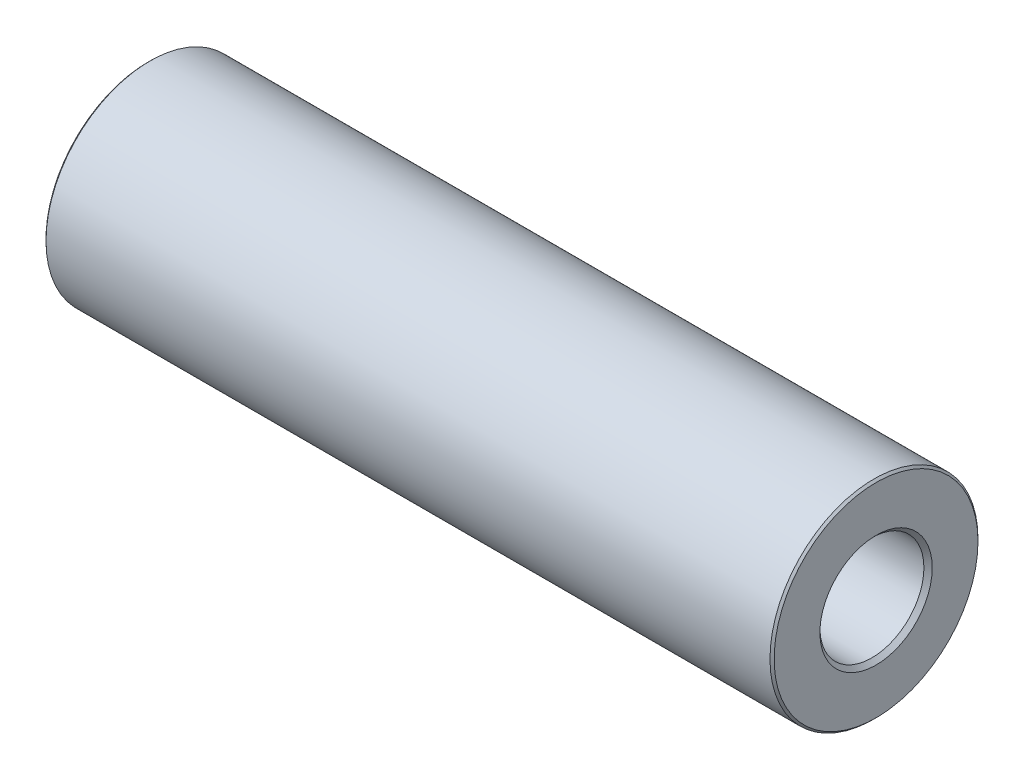
ISO-10303-21;
HEADER;
FILE_DESCRIPTION(('STEP AP214'),'2;1');
FILE_NAME('part.step','',(''),(''),'','','');
FILE_SCHEMA(('AUTOMOTIVE_DESIGN { 1 0 10303 214 1 1 1 1 }'));
ENDSEC;
DATA;
#1=APPLICATION_CONTEXT('core data for automotive mechanical design processes');
#2=APPLICATION_PROTOCOL_DEFINITION('international standard','automotive_design',2000,#1);
#3=PRODUCT_CONTEXT('',#1,'mechanical');
#4=PRODUCT('Part','Part','',(#3));
#5=PRODUCT_RELATED_PRODUCT_CATEGORY('part','',(#4));
#6=PRODUCT_DEFINITION_FORMATION('','',#4);
#7=PRODUCT_DEFINITION_CONTEXT('part definition',#1,'design');
#8=PRODUCT_DEFINITION('design','',#6,#7);
#9=PRODUCT_DEFINITION_SHAPE('','',#8);
#10=(LENGTH_UNIT() NAMED_UNIT(*) SI_UNIT(.MILLI.,.METRE.));
#11=(NAMED_UNIT(*) PLANE_ANGLE_UNIT() SI_UNIT($,.RADIAN.));
#12=(NAMED_UNIT(*) SI_UNIT($,.STERADIAN.) SOLID_ANGLE_UNIT());
#13=UNCERTAINTY_MEASURE_WITH_UNIT(LENGTH_MEASURE(1.E-05),#10,'distance_accuracy_value','');
#14=(GEOMETRIC_REPRESENTATION_CONTEXT(3) GLOBAL_UNCERTAINTY_ASSIGNED_CONTEXT((#13)) GLOBAL_UNIT_ASSIGNED_CONTEXT((#10,
#11,#12)) REPRESENTATION_CONTEXT('',''));
#15=CARTESIAN_POINT('',(0.,0.,0.));
#16=DIRECTION('',(0.,0.,1.));
#17=DIRECTION('',(1.,0.,0.));
#18=AXIS2_PLACEMENT_3D('',#15,#16,#17);
#19=CARTESIAN_POINT('',(35.,0.,0.));
#20=DIRECTION('',(1.,0.,0.));
#21=DIRECTION('',(0.,0.,-1.));
#22=AXIS2_PLACEMENT_3D('',#19,#20,#21);
#23=PLANE('',#22);
#24=CARTESIAN_POINT('',(35.,0.,0.));
#25=DIRECTION('',(1.,0.,0.));
#26=DIRECTION('',(0.,0.,-1.));
#27=AXIS2_PLACEMENT_3D('',#24,#25,#26);
#28=CIRCLE('',#27,4.9);
#29=CARTESIAN_POINT('',(35.,0.,-4.9));
#30=VERTEX_POINT('',#29);
#31=EDGE_CURVE('E8',#30,#30,#28,.T.);
#32=ORIENTED_EDGE('',*,*,#31,.T.);
#33=EDGE_LOOP('',(#32));
#34=FACE_BOUND('',#33,.T.);
#35=CARTESIAN_POINT('',(35.,0.,0.));
#36=DIRECTION('',(1.,0.,0.));
#37=DIRECTION('',(0.,0.,-1.));
#38=AXIS2_PLACEMENT_3D('',#35,#36,#37);
#39=CIRCLE('',#38,2.7);
#40=CARTESIAN_POINT('',(35.,0.,-2.7));
#41=VERTEX_POINT('',#40);
#42=EDGE_CURVE('E39',#41,#41,#39,.F.);
#43=ORIENTED_EDGE('',*,*,#42,.T.);
#44=EDGE_LOOP('',(#43));
#45=FACE_BOUND('',#44,.T.);
#46=ADVANCED_FACE('F13',(#34,#45),#23,.T.);
#47=CARTESIAN_POINT('',(0.,0.,0.));
#48=DIRECTION('',(1.,0.,0.));
#49=DIRECTION('',(0.,0.,-1.));
#50=AXIS2_PLACEMENT_3D('',#47,#48,#49);
#51=PLANE('',#50);
#52=CARTESIAN_POINT('',(0.,0.,0.));
#53=DIRECTION('',(1.,0.,0.));
#54=DIRECTION('',(0.,0.,-1.));
#55=AXIS2_PLACEMENT_3D('',#52,#53,#54);
#56=CIRCLE('',#55,2.59999999999999);
#57=CARTESIAN_POINT('',(0.,0.,-2.59999999999999));
#58=VERTEX_POINT('',#57);
#59=EDGE_CURVE('E33',#58,#58,#56,.T.);
#60=ORIENTED_EDGE('',*,*,#59,.T.);
#61=EDGE_LOOP('',(#60));
#62=FACE_BOUND('',#61,.T.);
#63=CARTESIAN_POINT('',(0.,0.,0.));
#64=DIRECTION('',(1.,0.,0.));
#65=DIRECTION('',(0.,0.,-1.));
#66=AXIS2_PLACEMENT_3D('',#63,#64,#65);
#67=CIRCLE('',#66,4.9);
#68=CARTESIAN_POINT('',(0.,0.,-4.9));
#69=VERTEX_POINT('',#68);
#70=EDGE_CURVE('E36',#69,#69,#67,.F.);
#71=ORIENTED_EDGE('',*,*,#70,.T.);
#72=EDGE_LOOP('',(#71));
#73=FACE_BOUND('',#72,.T.);
#74=ADVANCED_FACE('F67',(#62,#73),#51,.F.);
#75=CARTESIAN_POINT('',(35.,0.,0.));
#76=DIRECTION('',(-1.,0.,0.));
#77=DIRECTION('',(0.,0.,1.));
#78=AXIS2_PLACEMENT_3D('',#75,#76,#77);
#79=CYLINDRICAL_SURFACE('',#78,5.);
#80=CARTESIAN_POINT('',(0.100000000000003,0.,0.));
#81=DIRECTION('',(1.,0.,0.));
#82=DIRECTION('',(0.,0.,-1.));
#83=AXIS2_PLACEMENT_3D('',#80,#81,#82);
#84=CIRCLE('',#83,5.);
#85=CARTESIAN_POINT('',(0.100000000000003,0.,-5.));
#86=VERTEX_POINT('',#85);
#87=EDGE_CURVE('E20',#86,#86,#84,.T.);
#88=ORIENTED_EDGE('',*,*,#87,.T.);
#89=EDGE_LOOP('',(#88));
#90=FACE_BOUND('',#89,.T.);
#91=CARTESIAN_POINT('',(34.9,0.,0.));
#92=DIRECTION('',(1.,0.,0.));
#93=DIRECTION('',(0.,0.,-1.));
#94=AXIS2_PLACEMENT_3D('',#91,#92,#93);
#95=CIRCLE('',#94,5.);
#96=CARTESIAN_POINT('',(34.9,0.,-5.));
#97=VERTEX_POINT('',#96);
#98=EDGE_CURVE('E24',#97,#97,#95,.F.);
#99=ORIENTED_EDGE('',*,*,#98,.T.);
#100=EDGE_LOOP('',(#99));
#101=FACE_BOUND('',#100,.T.);
#102=ADVANCED_FACE('F61',(#90,#101),#79,.T.);
#103=CARTESIAN_POINT('',(35.,0.,0.));
#104=DIRECTION('',(-1.,0.,0.));
#105=DIRECTION('',(0.,0.,1.));
#106=AXIS2_PLACEMENT_3D('',#103,#104,#105);
#107=CYLINDRICAL_SURFACE('',#106,2.5);
#108=CARTESIAN_POINT('',(0.0999999999999959,0.,0.));
#109=DIRECTION('',(1.,0.,0.));
#110=DIRECTION('',(0.,0.,-1.));
#111=AXIS2_PLACEMENT_3D('',#108,#109,#110);
#112=CIRCLE('',#111,2.5);
#113=CARTESIAN_POINT('',(0.0999999999999959,0.,-2.5));
#114=VERTEX_POINT('',#113);
#115=EDGE_CURVE('E28',#114,#114,#112,.F.);
#116=ORIENTED_EDGE('',*,*,#115,.T.);
#117=EDGE_LOOP('',(#116));
#118=FACE_BOUND('',#117,.T.);
#119=CARTESIAN_POINT('',(34.8,0.,0.));
#120=DIRECTION('',(1.,0.,0.));
#121=DIRECTION('',(0.,0.,-1.));
#122=AXIS2_PLACEMENT_3D('',#119,#120,#121);
#123=CIRCLE('',#122,2.5);
#124=CARTESIAN_POINT('',(34.8,0.,-2.5));
#125=VERTEX_POINT('',#124);
#126=EDGE_CURVE('E42',#125,#125,#123,.T.);
#127=ORIENTED_EDGE('',*,*,#126,.T.);
#128=EDGE_LOOP('',(#127));
#129=FACE_BOUND('',#128,.T.);
#130=ADVANCED_FACE('F46',(#118,#129),#107,.F.);
#131=CARTESIAN_POINT('',(34.8,0.,0.));
#132=DIRECTION('',(1.,0.,0.));
#133=DIRECTION('',(0.,0.,-1.));
#134=AXIS2_PLACEMENT_3D('',#131,#132,#133);
#135=CONICAL_SURFACE('',#134,2.5,0.785398163397454);
#136=ORIENTED_EDGE('',*,*,#42,.F.);
#137=EDGE_LOOP('',(#136));
#138=FACE_BOUND('',#137,.T.);
#139=ORIENTED_EDGE('',*,*,#126,.F.);
#140=EDGE_LOOP('',(#139));
#141=FACE_BOUND('',#140,.T.);
#142=ADVANCED_FACE('F48',(#138,#141),#135,.F.);
#143=CARTESIAN_POINT('',(0.,0.,0.));
#144=DIRECTION('',(-1.,0.,0.));
#145=DIRECTION('',(0.,0.,1.));
#146=AXIS2_PLACEMENT_3D('',#143,#144,#145);
#147=CONICAL_SURFACE('',#146,2.59999999999999,0.785398163397442);
#148=ORIENTED_EDGE('',*,*,#115,.F.);
#149=EDGE_LOOP('',(#148));
#150=FACE_BOUND('',#149,.T.);
#151=ORIENTED_EDGE('',*,*,#59,.F.);
#152=EDGE_LOOP('',(#151));
#153=FACE_BOUND('',#152,.T.);
#154=ADVANCED_FACE('F50',(#150,#153),#147,.F.);
#155=CARTESIAN_POINT('',(0.100000000000003,0.,0.));
#156=DIRECTION('',(1.,0.,0.));
#157=DIRECTION('',(0.,0.,-1.));
#158=AXIS2_PLACEMENT_3D('',#155,#156,#157);
#159=CONICAL_SURFACE('',#158,5.,0.78539816339744);
#160=ORIENTED_EDGE('',*,*,#70,.F.);
#161=EDGE_LOOP('',(#160));
#162=FACE_BOUND('',#161,.T.);
#163=ORIENTED_EDGE('',*,*,#87,.F.);
#164=EDGE_LOOP('',(#163));
#165=FACE_BOUND('',#164,.T.);
#166=ADVANCED_FACE('F58',(#162,#165),#159,.T.);
#167=CARTESIAN_POINT('',(35.,0.,0.));
#168=DIRECTION('',(-1.,0.,0.));
#169=DIRECTION('',(0.,0.,1.));
#170=AXIS2_PLACEMENT_3D('',#167,#168,#169);
#171=CONICAL_SURFACE('',#170,4.9,0.785398163397492);
#172=ORIENTED_EDGE('',*,*,#98,.F.);
#173=EDGE_LOOP('',(#172));
#174=FACE_BOUND('',#173,.T.);
#175=ORIENTED_EDGE('',*,*,#31,.F.);
#176=EDGE_LOOP('',(#175));
#177=FACE_BOUND('',#176,.T.);
#178=ADVANCED_FACE('F15',(#174,#177),#171,.T.);
#179=CLOSED_SHELL('',(#46,#74,#102,#130,#142,#154,#166,#178));
#180=MANIFOLD_SOLID_BREP('B1',#179);
#181=ADVANCED_BREP_SHAPE_REPRESENTATION('',(#18,#180),#14);
#182=SHAPE_DEFINITION_REPRESENTATION(#9,#181);
ENDSEC;
END-ISO-10303-21;
